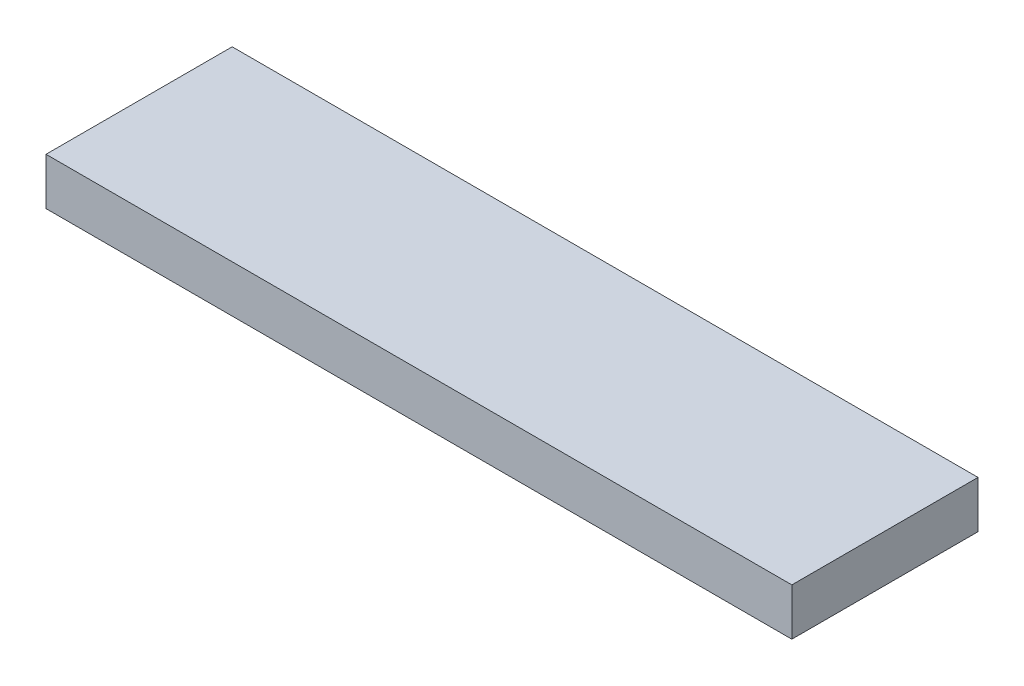
ISO-10303-21;
HEADER;
FILE_DESCRIPTION(('STEP AP214'),'2;1');
FILE_NAME('part.step','',(''),(''),'','','');
FILE_SCHEMA(('AUTOMOTIVE_DESIGN { 1 0 10303 214 1 1 1 1 }'));
ENDSEC;
DATA;
#1=APPLICATION_CONTEXT('core data for automotive mechanical design processes');
#2=APPLICATION_PROTOCOL_DEFINITION('international standard','automotive_design',2000,#1);
#3=PRODUCT_CONTEXT('',#1,'mechanical');
#4=PRODUCT('Part','Part','',(#3));
#5=PRODUCT_RELATED_PRODUCT_CATEGORY('part','',(#4));
#6=PRODUCT_DEFINITION_FORMATION('','',#4);
#7=PRODUCT_DEFINITION_CONTEXT('part definition',#1,'design');
#8=PRODUCT_DEFINITION('design','',#6,#7);
#9=PRODUCT_DEFINITION_SHAPE('','',#8);
#10=(LENGTH_UNIT() NAMED_UNIT(*) SI_UNIT(.MILLI.,.METRE.));
#11=(NAMED_UNIT(*) PLANE_ANGLE_UNIT() SI_UNIT($,.RADIAN.));
#12=(NAMED_UNIT(*) SI_UNIT($,.STERADIAN.) SOLID_ANGLE_UNIT());
#13=UNCERTAINTY_MEASURE_WITH_UNIT(LENGTH_MEASURE(1.E-05),#10,'distance_accuracy_value','');
#14=(GEOMETRIC_REPRESENTATION_CONTEXT(3) GLOBAL_UNCERTAINTY_ASSIGNED_CONTEXT((#13)) GLOBAL_UNIT_ASSIGNED_CONTEXT((#10,
#11,#12)) REPRESENTATION_CONTEXT('',''));
#15=CARTESIAN_POINT('',(0.,0.,0.));
#16=DIRECTION('',(0.,0.,1.));
#17=DIRECTION('',(1.,0.,0.));
#18=AXIS2_PLACEMENT_3D('',#15,#16,#17);
#19=CARTESIAN_POINT('',(79.2457733469104,10.,19.7801456379334));
#20=DIRECTION('',(-1.,0.,0.));
#21=DIRECTION('',(0.,0.,1.));
#22=AXIS2_PLACEMENT_3D('',#19,#20,#21);
#23=PLANE('',#22);
#24=DIRECTION('',(0.,0.,-1.));
#25=VECTOR('',#24,1.);
#26=CARTESIAN_POINT('',(79.2457733469104,0.,19.7801456379334));
#27=LINE('',#26,#25);
#28=CARTESIAN_POINT('',(79.2457733469104,0.,19.7801456379334));
#29=VERTEX_POINT('',#28);
#30=CARTESIAN_POINT('',(79.2457733469104,0.,-19.7801456379334));
#31=VERTEX_POINT('',#30);
#32=EDGE_CURVE('E96',#29,#31,#27,.T.);
#33=ORIENTED_EDGE('',*,*,#32,.T.);
#34=DIRECTION('',(0.,-1.,0.));
#35=VECTOR('',#34,1.);
#36=CARTESIAN_POINT('',(79.2457733469104,10.,-19.7801456379334));
#37=LINE('',#36,#35);
#38=CARTESIAN_POINT('',(79.2457733469104,10.,-19.7801456379334));
#39=VERTEX_POINT('',#38);
#40=EDGE_CURVE('E11',#39,#31,#37,.T.);
#41=ORIENTED_EDGE('',*,*,#40,.F.);
#42=DIRECTION('',(0.,0.,-1.));
#43=VECTOR('',#42,1.);
#44=CARTESIAN_POINT('',(79.2457733469104,10.,19.7801456379334));
#45=LINE('',#44,#43);
#46=CARTESIAN_POINT('',(79.2457733469104,10.,19.7801456379334));
#47=VERTEX_POINT('',#46);
#48=EDGE_CURVE('E84',#47,#39,#45,.T.);
#49=ORIENTED_EDGE('',*,*,#48,.F.);
#50=DIRECTION('',(0.,-1.,0.));
#51=VECTOR('',#50,1.);
#52=CARTESIAN_POINT('',(79.2457733469104,10.,19.7801456379334));
#53=LINE('',#52,#51);
#54=EDGE_CURVE('E92',#47,#29,#53,.T.);
#55=ORIENTED_EDGE('',*,*,#54,.T.);
#56=EDGE_LOOP('',(#33,#41,#49,#55));
#57=FACE_BOUND('',#56,.T.);
#58=ADVANCED_FACE('F33',(#57),#23,.F.);
#59=CARTESIAN_POINT('',(-79.2457733469104,10.,-19.7801456379334));
#60=DIRECTION('',(0.,0.,1.));
#61=DIRECTION('',(1.,0.,0.));
#62=AXIS2_PLACEMENT_3D('',#59,#60,#61);
#63=PLANE('',#62);
#64=DIRECTION('',(-1.,0.,0.));
#65=VECTOR('',#64,1.);
#66=CARTESIAN_POINT('',(-79.2457733469104,0.,-19.7801456379334));
#67=LINE('',#66,#65);
#68=CARTESIAN_POINT('',(-79.2457733469104,0.,-19.7801456379334));
#69=VERTEX_POINT('',#68);
#70=EDGE_CURVE('E88',#31,#69,#67,.T.);
#71=ORIENTED_EDGE('',*,*,#70,.T.);
#72=DIRECTION('',(0.,-1.,0.));
#73=VECTOR('',#72,1.);
#74=CARTESIAN_POINT('',(-79.2457733469104,10.,-19.7801456379334));
#75=LINE('',#74,#73);
#76=CARTESIAN_POINT('',(-79.2457733469104,10.,-19.7801456379334));
#77=VERTEX_POINT('',#76);
#78=EDGE_CURVE('E41',#77,#69,#75,.T.);
#79=ORIENTED_EDGE('',*,*,#78,.F.);
#80=DIRECTION('',(-1.,0.,0.));
#81=VECTOR('',#80,1.);
#82=CARTESIAN_POINT('',(-79.2457733469104,10.,-19.7801456379334));
#83=LINE('',#82,#81);
#84=EDGE_CURVE('E79',#39,#77,#83,.T.);
#85=ORIENTED_EDGE('',*,*,#84,.F.);
#86=ORIENTED_EDGE('',*,*,#40,.T.);
#87=EDGE_LOOP('',(#71,#79,#85,#86));
#88=FACE_BOUND('',#87,.T.);
#89=ADVANCED_FACE('F87',(#88),#63,.F.);
#90=CARTESIAN_POINT('',(-79.2457733469104,10.,19.7801456379334));
#91=DIRECTION('',(1.,0.,0.));
#92=DIRECTION('',(0.,0.,-1.));
#93=AXIS2_PLACEMENT_3D('',#90,#91,#92);
#94=PLANE('',#93);
#95=DIRECTION('',(0.,0.,1.));
#96=VECTOR('',#95,1.);
#97=CARTESIAN_POINT('',(-79.2457733469104,0.,19.7801456379334));
#98=LINE('',#97,#96);
#99=CARTESIAN_POINT('',(-79.2457733469104,0.,19.7801456379334));
#100=VERTEX_POINT('',#99);
#101=EDGE_CURVE('E66',#69,#100,#98,.T.);
#102=ORIENTED_EDGE('',*,*,#101,.T.);
#103=DIRECTION('',(0.,-1.,0.));
#104=VECTOR('',#103,1.);
#105=CARTESIAN_POINT('',(-79.2457733469104,10.,19.7801456379334));
#106=LINE('',#105,#104);
#107=CARTESIAN_POINT('',(-79.2457733469104,10.,19.7801456379334));
#108=VERTEX_POINT('',#107);
#109=EDGE_CURVE('E89',#108,#100,#106,.T.);
#110=ORIENTED_EDGE('',*,*,#109,.F.);
#111=DIRECTION('',(0.,0.,1.));
#112=VECTOR('',#111,1.);
#113=CARTESIAN_POINT('',(-79.2457733469104,10.,19.7801456379334));
#114=LINE('',#113,#112);
#115=EDGE_CURVE('E82',#77,#108,#114,.T.);
#116=ORIENTED_EDGE('',*,*,#115,.F.);
#117=ORIENTED_EDGE('',*,*,#78,.T.);
#118=EDGE_LOOP('',(#102,#110,#116,#117));
#119=FACE_BOUND('',#118,.T.);
#120=ADVANCED_FACE('F90',(#119),#94,.F.);
#121=CARTESIAN_POINT('',(-79.2457733469104,10.,19.7801456379334));
#122=DIRECTION('',(0.,0.,-1.));
#123=DIRECTION('',(-1.,0.,0.));
#124=AXIS2_PLACEMENT_3D('',#121,#122,#123);
#125=PLANE('',#124);
#126=DIRECTION('',(1.,0.,0.));
#127=VECTOR('',#126,1.);
#128=CARTESIAN_POINT('',(-79.2457733469104,0.,19.7801456379334));
#129=LINE('',#128,#127);
#130=EDGE_CURVE('E72',#100,#29,#129,.T.);
#131=ORIENTED_EDGE('',*,*,#130,.T.);
#132=ORIENTED_EDGE('',*,*,#54,.F.);
#133=DIRECTION('',(1.,0.,0.));
#134=VECTOR('',#133,1.);
#135=CARTESIAN_POINT('',(-79.2457733469104,10.,19.7801456379334));
#136=LINE('',#135,#134);
#137=EDGE_CURVE('E49',#108,#47,#136,.T.);
#138=ORIENTED_EDGE('',*,*,#137,.F.);
#139=ORIENTED_EDGE('',*,*,#109,.T.);
#140=EDGE_LOOP('',(#131,#132,#138,#139));
#141=FACE_BOUND('',#140,.T.);
#142=ADVANCED_FACE('F103',(#141),#125,.F.);
#143=CARTESIAN_POINT('',(0.,10.,0.));
#144=DIRECTION('',(0.,-1.,0.));
#145=DIRECTION('',(0.,0.,-1.));
#146=AXIS2_PLACEMENT_3D('',#143,#144,#145);
#147=PLANE('',#146);
#148=ORIENTED_EDGE('',*,*,#48,.T.);
#149=ORIENTED_EDGE('',*,*,#84,.T.);
#150=ORIENTED_EDGE('',*,*,#115,.T.);
#151=ORIENTED_EDGE('',*,*,#137,.T.);
#152=EDGE_LOOP('',(#148,#149,#150,#151));
#153=FACE_BOUND('',#152,.T.);
#154=ADVANCED_FACE('F80',(#153),#147,.F.);
#155=CARTESIAN_POINT('',(0.,0.,0.));
#156=DIRECTION('',(0.,-1.,0.));
#157=DIRECTION('',(0.,0.,-1.));
#158=AXIS2_PLACEMENT_3D('',#155,#156,#157);
#159=PLANE('',#158);
#160=ORIENTED_EDGE('',*,*,#32,.F.);
#161=ORIENTED_EDGE('',*,*,#130,.F.);
#162=ORIENTED_EDGE('',*,*,#101,.F.);
#163=ORIENTED_EDGE('',*,*,#70,.F.);
#164=EDGE_LOOP('',(#160,#161,#162,#163));
#165=FACE_BOUND('',#164,.T.);
#166=ADVANCED_FACE('F106',(#165),#159,.T.);
#167=CLOSED_SHELL('',(#58,#89,#120,#142,#154,#166));
#168=MANIFOLD_SOLID_BREP('B2',#167);
#169=ADVANCED_BREP_SHAPE_REPRESENTATION('',(#18,#168),#14);
#170=SHAPE_DEFINITION_REPRESENTATION(#9,#169);
ENDSEC;
END-ISO-10303-21;
